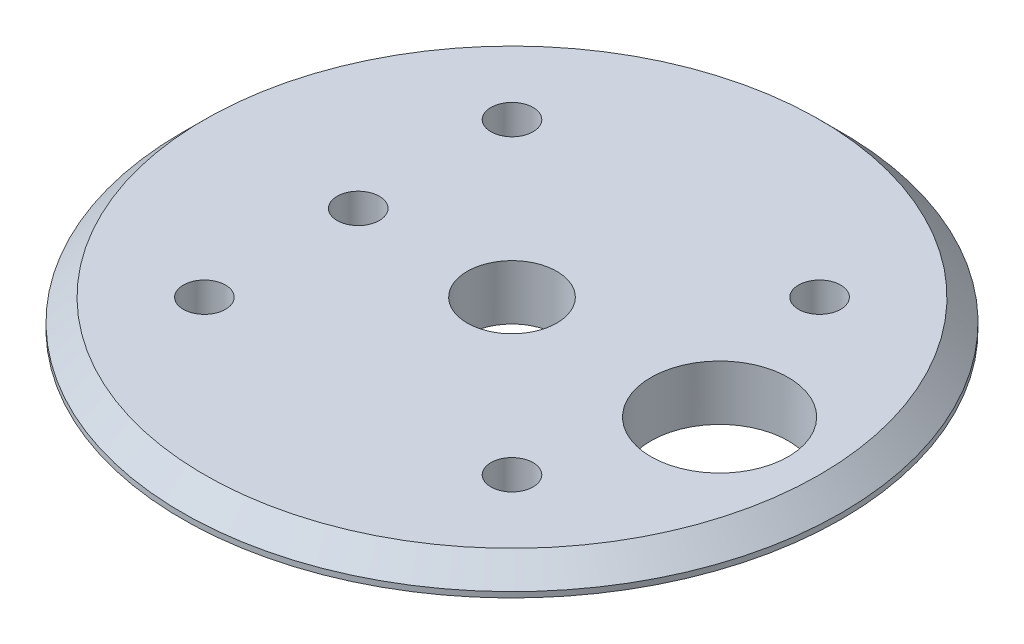
ISO-10303-21;
HEADER;
FILE_DESCRIPTION(('STEP AP214'),'2;1');
FILE_NAME('part.step','',(''),(''),'','','');
FILE_SCHEMA(('AUTOMOTIVE_DESIGN { 1 0 10303 214 1 1 1 1 }'));
ENDSEC;
DATA;
#1=APPLICATION_CONTEXT('core data for automotive mechanical design processes');
#2=APPLICATION_PROTOCOL_DEFINITION('international standard','automotive_design',2000,#1);
#3=PRODUCT_CONTEXT('',#1,'mechanical');
#4=PRODUCT('Part','Part','',(#3));
#5=PRODUCT_RELATED_PRODUCT_CATEGORY('part','',(#4));
#6=PRODUCT_DEFINITION_FORMATION('','',#4);
#7=PRODUCT_DEFINITION_CONTEXT('part definition',#1,'design');
#8=PRODUCT_DEFINITION('design','',#6,#7);
#9=PRODUCT_DEFINITION_SHAPE('','',#8);
#10=(LENGTH_UNIT() NAMED_UNIT(*) SI_UNIT(.MILLI.,.METRE.));
#11=(NAMED_UNIT(*) PLANE_ANGLE_UNIT() SI_UNIT($,.RADIAN.));
#12=(NAMED_UNIT(*) SI_UNIT($,.STERADIAN.) SOLID_ANGLE_UNIT());
#13=UNCERTAINTY_MEASURE_WITH_UNIT(LENGTH_MEASURE(1.E-05),#10,'distance_accuracy_value','');
#14=(GEOMETRIC_REPRESENTATION_CONTEXT(3) GLOBAL_UNCERTAINTY_ASSIGNED_CONTEXT((#13)) GLOBAL_UNIT_ASSIGNED_CONTEXT((#10,
#11,#12)) REPRESENTATION_CONTEXT('',''));
#15=CARTESIAN_POINT('',(0.,0.,0.));
#16=DIRECTION('',(0.,0.,1.));
#17=DIRECTION('',(1.,0.,0.));
#18=AXIS2_PLACEMENT_3D('',#15,#16,#17);
#19=CARTESIAN_POINT('',(0.,3.175,0.));
#20=DIRECTION('',(0.,-1.,0.));
#21=DIRECTION('',(1.,0.,0.));
#22=AXIS2_PLACEMENT_3D('',#19,#20,#21);
#23=PLANE('',#22);
#24=CARTESIAN_POINT('',(0.,3.175,0.));
#25=DIRECTION('',(0.,-1.,0.));
#26=DIRECTION('',(1.,0.,0.));
#27=AXIS2_PLACEMENT_3D('',#24,#25,#26);
#28=CIRCLE('',#27,17.78);
#29=CARTESIAN_POINT('',(17.78,3.175,0.));
#30=VERTEX_POINT('',#29);
#31=EDGE_CURVE('E47',#30,#30,#28,.F.);
#32=ORIENTED_EDGE('',*,*,#31,.T.);
#33=EDGE_LOOP('',(#32));
#34=FACE_BOUND('',#33,.T.);
#35=CARTESIAN_POINT('',(-8.89,3.175,0.));
#36=DIRECTION('',(0.,1.,0.));
#37=DIRECTION('',(0.,0.,1.));
#38=AXIS2_PLACEMENT_3D('',#35,#36,#37);
#39=CIRCLE('',#38,1.2192);
#40=CARTESIAN_POINT('',(-8.89,3.175,1.2192));
#41=VERTEX_POINT('',#40);
#42=EDGE_CURVE('E66',#41,#41,#39,.T.);
#43=ORIENTED_EDGE('',*,*,#42,.F.);
#44=EDGE_LOOP('',(#43));
#45=FACE_BOUND('',#44,.T.);
#46=CARTESIAN_POINT('',(8.89,3.175,8.89));
#47=DIRECTION('',(0.,1.,0.));
#48=DIRECTION('',(0.,0.,1.));
#49=AXIS2_PLACEMENT_3D('',#46,#47,#48);
#50=CIRCLE('',#49,1.2192);
#51=CARTESIAN_POINT('',(8.89,3.175,10.1092));
#52=VERTEX_POINT('',#51);
#53=EDGE_CURVE('E72',#52,#52,#50,.T.);
#54=ORIENTED_EDGE('',*,*,#53,.F.);
#55=EDGE_LOOP('',(#54));
#56=FACE_BOUND('',#55,.T.);
#57=CARTESIAN_POINT('',(-8.89,3.175,8.89));
#58=DIRECTION('',(0.,1.,0.));
#59=DIRECTION('',(0.,0.,1.));
#60=AXIS2_PLACEMENT_3D('',#57,#58,#59);
#61=CIRCLE('',#60,1.2192);
#62=CARTESIAN_POINT('',(-8.89,3.175,10.1092));
#63=VERTEX_POINT('',#62);
#64=EDGE_CURVE('E78',#63,#63,#61,.T.);
#65=ORIENTED_EDGE('',*,*,#64,.F.);
#66=EDGE_LOOP('',(#65));
#67=FACE_BOUND('',#66,.T.);
#68=CARTESIAN_POINT('',(8.89,3.175,-8.89));
#69=DIRECTION('',(0.,1.,0.));
#70=DIRECTION('',(0.,0.,1.));
#71=AXIS2_PLACEMENT_3D('',#68,#69,#70);
#72=CIRCLE('',#71,1.2192);
#73=CARTESIAN_POINT('',(8.89,3.175,-7.6708));
#74=VERTEX_POINT('',#73);
#75=EDGE_CURVE('E84',#74,#74,#72,.T.);
#76=ORIENTED_EDGE('',*,*,#75,.F.);
#77=EDGE_LOOP('',(#76));
#78=FACE_BOUND('',#77,.T.);
#79=CARTESIAN_POINT('',(-8.89,3.175,-8.89));
#80=DIRECTION('',(0.,1.,0.));
#81=DIRECTION('',(0.,0.,1.));
#82=AXIS2_PLACEMENT_3D('',#79,#80,#81);
#83=CIRCLE('',#82,1.2192);
#84=CARTESIAN_POINT('',(-8.89,3.175,-7.6708));
#85=VERTEX_POINT('',#84);
#86=EDGE_CURVE('E90',#85,#85,#83,.T.);
#87=ORIENTED_EDGE('',*,*,#86,.F.);
#88=EDGE_LOOP('',(#87));
#89=FACE_BOUND('',#88,.T.);
#90=CARTESIAN_POINT('',(0.,3.175,0.));
#91=DIRECTION('',(0.,1.,0.));
#92=DIRECTION('',(0.,0.,1.));
#93=AXIS2_PLACEMENT_3D('',#90,#91,#92);
#94=CIRCLE('',#93,2.5908);
#95=CARTESIAN_POINT('',(0.,3.175,2.5908));
#96=VERTEX_POINT('',#95);
#97=EDGE_CURVE('E96',#96,#96,#94,.T.);
#98=ORIENTED_EDGE('',*,*,#97,.F.);
#99=EDGE_LOOP('',(#98));
#100=FACE_BOUND('',#99,.T.);
#101=CARTESIAN_POINT('',(12.,3.175,0.));
#102=DIRECTION('',(0.,1.,0.));
#103=DIRECTION('',(0.,0.,1.));
#104=AXIS2_PLACEMENT_3D('',#101,#102,#103);
#105=CIRCLE('',#104,3.96875);
#106=CARTESIAN_POINT('',(12.,3.175,3.96875));
#107=VERTEX_POINT('',#106);
#108=EDGE_CURVE('E102',#107,#107,#105,.T.);
#109=ORIENTED_EDGE('',*,*,#108,.F.);
#110=EDGE_LOOP('',(#109));
#111=FACE_BOUND('',#110,.T.);
#112=ADVANCED_FACE('F39',(#34,#45,#56,#67,#78,#89,#100,#111),#23,.F.);
#113=CARTESIAN_POINT('',(0.,8.0393649546647,0.));
#114=DIRECTION('',(0.,1.,0.));
#115=DIRECTION('',(-1.,0.,0.));
#116=AXIS2_PLACEMENT_3D('',#113,#114,#115);
#117=CYLINDRICAL_SURFACE('',#116,19.05);
#118=CARTESIAN_POINT('',(0.,1.905,0.));
#119=DIRECTION('',(0.,-1.,0.));
#120=DIRECTION('',(1.,0.,0.));
#121=AXIS2_PLACEMENT_3D('',#118,#119,#120);
#122=CIRCLE('',#121,19.05);
#123=CARTESIAN_POINT('',(19.05,1.905,0.));
#124=VERTEX_POINT('',#123);
#125=EDGE_CURVE('E10',#124,#124,#122,.T.);
#126=ORIENTED_EDGE('',*,*,#125,.T.);
#127=EDGE_LOOP('',(#126));
#128=FACE_BOUND('',#127,.T.);
#129=CARTESIAN_POINT('',(0.,1.5875,0.));
#130=DIRECTION('',(0.,1.,0.));
#131=DIRECTION('',(-1.,0.,0.));
#132=AXIS2_PLACEMENT_3D('',#129,#130,#131);
#133=CIRCLE('',#132,19.05);
#134=CARTESIAN_POINT('',(-19.05,1.58750000000001,0.));
#135=VERTEX_POINT('',#134);
#136=EDGE_CURVE('E51',#135,#135,#133,.T.);
#137=ORIENTED_EDGE('',*,*,#136,.T.);
#138=EDGE_LOOP('',(#137));
#139=FACE_BOUND('',#138,.T.);
#140=ADVANCED_FACE('F109',(#128,#139),#117,.T.);
#141=CARTESIAN_POINT('',(19.05,1.5875,0.));
#142=DIRECTION('',(0.,1.,0.));
#143=DIRECTION('',(-1.,0.,0.));
#144=AXIS2_PLACEMENT_3D('',#141,#142,#143);
#145=PLANE('',#144);
#146=ORIENTED_EDGE('',*,*,#136,.F.);
#147=EDGE_LOOP('',(#146));
#148=FACE_BOUND('',#147,.T.);
#149=CARTESIAN_POINT('',(0.,1.5875,0.));
#150=DIRECTION('',(0.,1.,0.));
#151=DIRECTION('',(-1.,0.,0.));
#152=AXIS2_PLACEMENT_3D('',#149,#150,#151);
#153=CIRCLE('',#152,16.51);
#154=CARTESIAN_POINT('',(-16.51,1.5875,0.));
#155=VERTEX_POINT('',#154);
#156=EDGE_CURVE('E55',#155,#155,#153,.T.);
#157=ORIENTED_EDGE('',*,*,#156,.T.);
#158=EDGE_LOOP('',(#157));
#159=FACE_BOUND('',#158,.T.);
#160=ADVANCED_FACE('F113',(#148,#159),#145,.F.);
#161=CARTESIAN_POINT('',(0.,8.0393649546647,0.));
#162=DIRECTION('',(0.,1.,0.));
#163=DIRECTION('',(-1.,0.,0.));
#164=AXIS2_PLACEMENT_3D('',#161,#162,#163);
#165=CYLINDRICAL_SURFACE('',#164,16.51);
#166=ORIENTED_EDGE('',*,*,#156,.F.);
#167=EDGE_LOOP('',(#166));
#168=FACE_BOUND('',#167,.T.);
#169=CARTESIAN_POINT('',(0.,0.,0.));
#170=DIRECTION('',(0.,1.,0.));
#171=DIRECTION('',(-1.,0.,0.));
#172=AXIS2_PLACEMENT_3D('',#169,#170,#171);
#173=CIRCLE('',#172,16.51);
#174=CARTESIAN_POINT('',(-16.51,0.,0.));
#175=VERTEX_POINT('',#174);
#176=EDGE_CURVE('E60',#175,#175,#173,.T.);
#177=ORIENTED_EDGE('',*,*,#176,.T.);
#178=EDGE_LOOP('',(#177));
#179=FACE_BOUND('',#178,.T.);
#180=ADVANCED_FACE('F119',(#168,#179),#165,.T.);
#181=CARTESIAN_POINT('',(16.51,0.,0.));
#182=DIRECTION('',(0.,1.,0.));
#183=DIRECTION('',(-1.,0.,0.));
#184=AXIS2_PLACEMENT_3D('',#181,#182,#183);
#185=PLANE('',#184);
#186=CARTESIAN_POINT('',(12.,0.,0.));
#187=DIRECTION('',(0.,1.,0.));
#188=DIRECTION('',(-1.,0.,0.));
#189=AXIS2_PLACEMENT_3D('',#186,#187,#188);
#190=CIRCLE('',#189,3.96875);
#191=CARTESIAN_POINT('',(8.03125,0.,0.));
#192=VERTEX_POINT('',#191);
#193=EDGE_CURVE('E99',#192,#192,#190,.T.);
#194=ORIENTED_EDGE('',*,*,#193,.T.);
#195=EDGE_LOOP('',(#194));
#196=FACE_BOUND('',#195,.T.);
#197=CARTESIAN_POINT('',(0.,0.,0.));
#198=DIRECTION('',(0.,1.,0.));
#199=DIRECTION('',(-1.,0.,0.));
#200=AXIS2_PLACEMENT_3D('',#197,#198,#199);
#201=CIRCLE('',#200,2.5908);
#202=CARTESIAN_POINT('',(-2.5908,0.,0.));
#203=VERTEX_POINT('',#202);
#204=EDGE_CURVE('E93',#203,#203,#201,.T.);
#205=ORIENTED_EDGE('',*,*,#204,.T.);
#206=EDGE_LOOP('',(#205));
#207=FACE_BOUND('',#206,.T.);
#208=CARTESIAN_POINT('',(-8.89,0.,-8.89));
#209=DIRECTION('',(0.,1.,0.));
#210=DIRECTION('',(-1.,0.,0.));
#211=AXIS2_PLACEMENT_3D('',#208,#209,#210);
#212=CIRCLE('',#211,1.2192);
#213=CARTESIAN_POINT('',(-10.1092,0.,-8.89));
#214=VERTEX_POINT('',#213);
#215=EDGE_CURVE('E87',#214,#214,#212,.T.);
#216=ORIENTED_EDGE('',*,*,#215,.T.);
#217=EDGE_LOOP('',(#216));
#218=FACE_BOUND('',#217,.T.);
#219=CARTESIAN_POINT('',(8.89,0.,-8.89));
#220=DIRECTION('',(0.,1.,0.));
#221=DIRECTION('',(-1.,0.,0.));
#222=AXIS2_PLACEMENT_3D('',#219,#220,#221);
#223=CIRCLE('',#222,1.2192);
#224=CARTESIAN_POINT('',(7.6708,0.,-8.89));
#225=VERTEX_POINT('',#224);
#226=EDGE_CURVE('E81',#225,#225,#223,.T.);
#227=ORIENTED_EDGE('',*,*,#226,.T.);
#228=EDGE_LOOP('',(#227));
#229=FACE_BOUND('',#228,.T.);
#230=CARTESIAN_POINT('',(-8.89,0.,8.89));
#231=DIRECTION('',(0.,1.,0.));
#232=DIRECTION('',(-1.,0.,0.));
#233=AXIS2_PLACEMENT_3D('',#230,#231,#232);
#234=CIRCLE('',#233,1.2192);
#235=CARTESIAN_POINT('',(-10.1092,0.,8.89));
#236=VERTEX_POINT('',#235);
#237=EDGE_CURVE('E75',#236,#236,#234,.T.);
#238=ORIENTED_EDGE('',*,*,#237,.T.);
#239=EDGE_LOOP('',(#238));
#240=FACE_BOUND('',#239,.T.);
#241=CARTESIAN_POINT('',(8.89,0.,8.89));
#242=DIRECTION('',(0.,1.,0.));
#243=DIRECTION('',(-1.,0.,0.));
#244=AXIS2_PLACEMENT_3D('',#241,#242,#243);
#245=CIRCLE('',#244,1.2192);
#246=CARTESIAN_POINT('',(7.6708,0.,8.89));
#247=VERTEX_POINT('',#246);
#248=EDGE_CURVE('E69',#247,#247,#245,.T.);
#249=ORIENTED_EDGE('',*,*,#248,.T.);
#250=EDGE_LOOP('',(#249));
#251=FACE_BOUND('',#250,.T.);
#252=CARTESIAN_POINT('',(-8.89,0.,0.));
#253=DIRECTION('',(0.,1.,0.));
#254=DIRECTION('',(-1.,0.,0.));
#255=AXIS2_PLACEMENT_3D('',#252,#253,#254);
#256=CIRCLE('',#255,1.2192);
#257=CARTESIAN_POINT('',(-10.1092,0.,0.));
#258=VERTEX_POINT('',#257);
#259=EDGE_CURVE('E63',#258,#258,#256,.T.);
#260=ORIENTED_EDGE('',*,*,#259,.T.);
#261=EDGE_LOOP('',(#260));
#262=FACE_BOUND('',#261,.T.);
#263=ORIENTED_EDGE('',*,*,#176,.F.);
#264=EDGE_LOOP('',(#263));
#265=FACE_BOUND('',#264,.T.);
#266=ADVANCED_FACE('F123',(#196,#207,#218,#229,#240,#251,#262,#265),#185,.F.);
#267=CARTESIAN_POINT('',(-8.89,3.175,0.));
#268=DIRECTION('',(0.,1.,0.));
#269=DIRECTION('',(0.,0.,1.));
#270=AXIS2_PLACEMENT_3D('',#267,#268,#269);
#271=CYLINDRICAL_SURFACE('',#270,1.2192);
#272=ORIENTED_EDGE('',*,*,#259,.F.);
#273=EDGE_LOOP('',(#272));
#274=FACE_BOUND('',#273,.T.);
#275=ORIENTED_EDGE('',*,*,#42,.T.);
#276=EDGE_LOOP('',(#275));
#277=FACE_BOUND('',#276,.T.);
#278=ADVANCED_FACE('F127',(#274,#277),#271,.F.);
#279=CARTESIAN_POINT('',(8.89,3.175,8.89));
#280=DIRECTION('',(0.,1.,0.));
#281=DIRECTION('',(0.,0.,1.));
#282=AXIS2_PLACEMENT_3D('',#279,#280,#281);
#283=CYLINDRICAL_SURFACE('',#282,1.2192);
#284=ORIENTED_EDGE('',*,*,#248,.F.);
#285=EDGE_LOOP('',(#284));
#286=FACE_BOUND('',#285,.T.);
#287=ORIENTED_EDGE('',*,*,#53,.T.);
#288=EDGE_LOOP('',(#287));
#289=FACE_BOUND('',#288,.T.);
#290=ADVANCED_FACE('F131',(#286,#289),#283,.F.);
#291=CARTESIAN_POINT('',(-8.89,3.175,8.89));
#292=DIRECTION('',(0.,1.,0.));
#293=DIRECTION('',(0.,0.,1.));
#294=AXIS2_PLACEMENT_3D('',#291,#292,#293);
#295=CYLINDRICAL_SURFACE('',#294,1.2192);
#296=ORIENTED_EDGE('',*,*,#237,.F.);
#297=EDGE_LOOP('',(#296));
#298=FACE_BOUND('',#297,.T.);
#299=ORIENTED_EDGE('',*,*,#64,.T.);
#300=EDGE_LOOP('',(#299));
#301=FACE_BOUND('',#300,.T.);
#302=ADVANCED_FACE('F135',(#298,#301),#295,.F.);
#303=CARTESIAN_POINT('',(8.89,3.175,-8.89));
#304=DIRECTION('',(0.,1.,0.));
#305=DIRECTION('',(0.,0.,1.));
#306=AXIS2_PLACEMENT_3D('',#303,#304,#305);
#307=CYLINDRICAL_SURFACE('',#306,1.2192);
#308=ORIENTED_EDGE('',*,*,#226,.F.);
#309=EDGE_LOOP('',(#308));
#310=FACE_BOUND('',#309,.T.);
#311=ORIENTED_EDGE('',*,*,#75,.T.);
#312=EDGE_LOOP('',(#311));
#313=FACE_BOUND('',#312,.T.);
#314=ADVANCED_FACE('F139',(#310,#313),#307,.F.);
#315=CARTESIAN_POINT('',(-8.89,3.175,-8.89));
#316=DIRECTION('',(0.,1.,0.));
#317=DIRECTION('',(0.,0.,1.));
#318=AXIS2_PLACEMENT_3D('',#315,#316,#317);
#319=CYLINDRICAL_SURFACE('',#318,1.2192);
#320=ORIENTED_EDGE('',*,*,#215,.F.);
#321=EDGE_LOOP('',(#320));
#322=FACE_BOUND('',#321,.T.);
#323=ORIENTED_EDGE('',*,*,#86,.T.);
#324=EDGE_LOOP('',(#323));
#325=FACE_BOUND('',#324,.T.);
#326=ADVANCED_FACE('F143',(#322,#325),#319,.F.);
#327=CARTESIAN_POINT('',(0.,3.175,0.));
#328=DIRECTION('',(0.,1.,0.));
#329=DIRECTION('',(0.,0.,1.));
#330=AXIS2_PLACEMENT_3D('',#327,#328,#329);
#331=CYLINDRICAL_SURFACE('',#330,2.5908);
#332=ORIENTED_EDGE('',*,*,#204,.F.);
#333=EDGE_LOOP('',(#332));
#334=FACE_BOUND('',#333,.T.);
#335=ORIENTED_EDGE('',*,*,#97,.T.);
#336=EDGE_LOOP('',(#335));
#337=FACE_BOUND('',#336,.T.);
#338=ADVANCED_FACE('F147',(#334,#337),#331,.F.);
#339=CARTESIAN_POINT('',(12.,3.175,0.));
#340=DIRECTION('',(0.,1.,0.));
#341=DIRECTION('',(0.,0.,1.));
#342=AXIS2_PLACEMENT_3D('',#339,#340,#341);
#343=CYLINDRICAL_SURFACE('',#342,3.96875);
#344=ORIENTED_EDGE('',*,*,#193,.F.);
#345=EDGE_LOOP('',(#344));
#346=FACE_BOUND('',#345,.T.);
#347=ORIENTED_EDGE('',*,*,#108,.T.);
#348=EDGE_LOOP('',(#347));
#349=FACE_BOUND('',#348,.T.);
#350=ADVANCED_FACE('F106',(#346,#349),#343,.F.);
#351=CARTESIAN_POINT('',(0.,3.175,0.));
#352=DIRECTION('',(0.,-1.,0.));
#353=DIRECTION('',(1.,0.,0.));
#354=AXIS2_PLACEMENT_3D('',#351,#352,#353);
#355=CONICAL_SURFACE('',#354,17.78,0.785398163397446);
#356=ORIENTED_EDGE('',*,*,#125,.F.);
#357=EDGE_LOOP('',(#356));
#358=FACE_BOUND('',#357,.T.);
#359=ORIENTED_EDGE('',*,*,#31,.F.);
#360=EDGE_LOOP('',(#359));
#361=FACE_BOUND('',#360,.T.);
#362=ADVANCED_FACE('F42',(#358,#361),#355,.T.);
#363=CLOSED_SHELL('',(#112,#140,#160,#180,#266,#278,#290,#302,#314,#326,#338,#350,#362));
#364=MANIFOLD_SOLID_BREP('B2',#363);
#365=ADVANCED_BREP_SHAPE_REPRESENTATION('',(#18,#364),#14);
#366=SHAPE_DEFINITION_REPRESENTATION(#9,#365);
ENDSEC;
END-ISO-10303-21;
